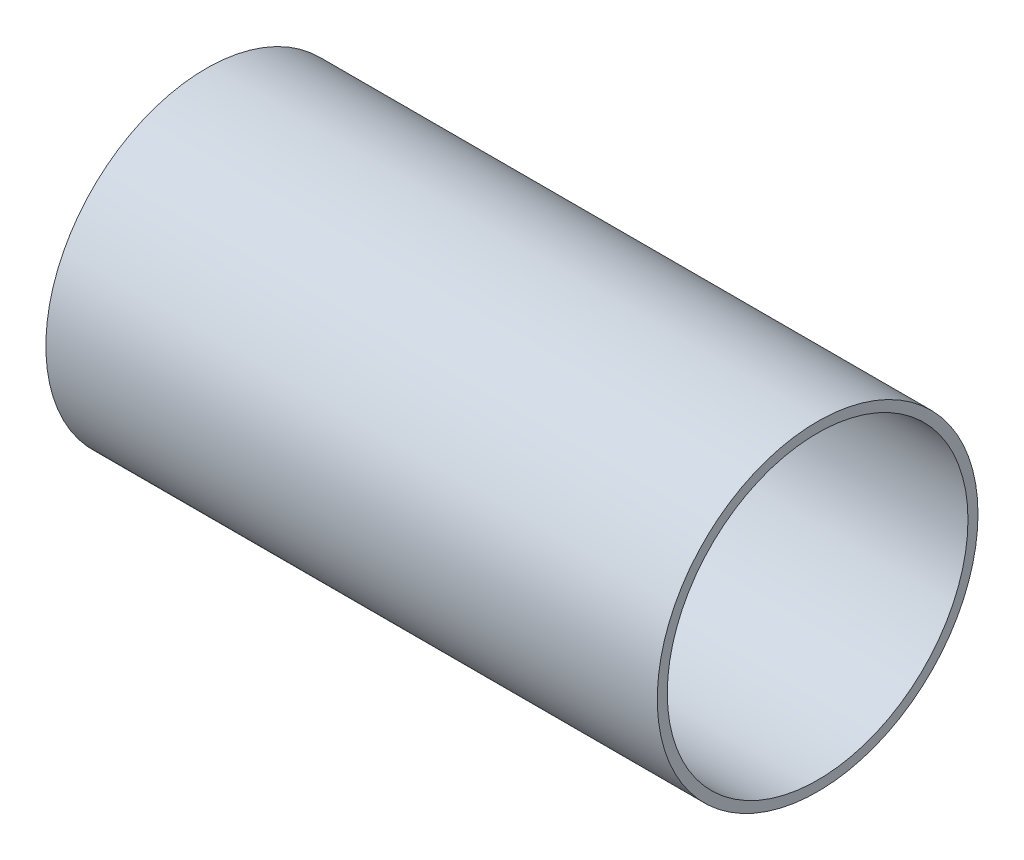
ISO-10303-21;
HEADER;
FILE_DESCRIPTION(('STEP AP214'),'2;1');
FILE_NAME('part.step','',(''),(''),'','','');
FILE_SCHEMA(('AUTOMOTIVE_DESIGN { 1 0 10303 214 1 1 1 1 }'));
ENDSEC;
DATA;
#1=APPLICATION_CONTEXT('core data for automotive mechanical design processes');
#2=APPLICATION_PROTOCOL_DEFINITION('international standard','automotive_design',2000,#1);
#3=PRODUCT_CONTEXT('',#1,'mechanical');
#4=PRODUCT('Part','Part','',(#3));
#5=PRODUCT_RELATED_PRODUCT_CATEGORY('part','',(#4));
#6=PRODUCT_DEFINITION_FORMATION('','',#4);
#7=PRODUCT_DEFINITION_CONTEXT('part definition',#1,'design');
#8=PRODUCT_DEFINITION('design','',#6,#7);
#9=PRODUCT_DEFINITION_SHAPE('','',#8);
#10=(LENGTH_UNIT() NAMED_UNIT(*) SI_UNIT(.MILLI.,.METRE.));
#11=(NAMED_UNIT(*) PLANE_ANGLE_UNIT() SI_UNIT($,.RADIAN.));
#12=(NAMED_UNIT(*) SI_UNIT($,.STERADIAN.) SOLID_ANGLE_UNIT());
#13=UNCERTAINTY_MEASURE_WITH_UNIT(LENGTH_MEASURE(1.E-05),#10,'distance_accuracy_value','');
#14=(GEOMETRIC_REPRESENTATION_CONTEXT(3) GLOBAL_UNCERTAINTY_ASSIGNED_CONTEXT((#13)) GLOBAL_UNIT_ASSIGNED_CONTEXT((#10,
#11,#12)) REPRESENTATION_CONTEXT('',''));
#15=CARTESIAN_POINT('',(0.,0.,0.));
#16=DIRECTION('',(0.,0.,1.));
#17=DIRECTION('',(1.,0.,0.));
#18=AXIS2_PLACEMENT_3D('',#15,#16,#17);
#19=CARTESIAN_POINT('',(387.35,0.,0.));
#20=DIRECTION('',(1.,0.,0.));
#21=DIRECTION('',(0.,0.,-1.));
#22=AXIS2_PLACEMENT_3D('',#19,#20,#21);
#23=PLANE('',#22);
#24=CARTESIAN_POINT('',(387.35,0.,0.));
#25=DIRECTION('',(1.,0.,0.));
#26=DIRECTION('',(0.,0.,-1.));
#27=AXIS2_PLACEMENT_3D('',#24,#25,#26);
#28=CIRCLE('',#27,101.6);
#29=CARTESIAN_POINT('',(387.35,0.,-101.6));
#30=VERTEX_POINT('',#29);
#31=EDGE_CURVE('E10',#30,#30,#28,.T.);
#32=ORIENTED_EDGE('',*,*,#31,.T.);
#33=EDGE_LOOP('',(#32));
#34=FACE_BOUND('',#33,.T.);
#35=CARTESIAN_POINT('',(387.35,0.,0.));
#36=DIRECTION('',(1.,0.,0.));
#37=DIRECTION('',(0.,0.,-1.));
#38=AXIS2_PLACEMENT_3D('',#35,#36,#37);
#39=CIRCLE('',#38,95.25);
#40=CARTESIAN_POINT('',(387.35,0.,-95.25));
#41=VERTEX_POINT('',#40);
#42=EDGE_CURVE('E54',#41,#41,#39,.T.);
#43=ORIENTED_EDGE('',*,*,#42,.F.);
#44=EDGE_LOOP('',(#43));
#45=FACE_BOUND('',#44,.T.);
#46=ADVANCED_FACE('F41',(#34,#45),#23,.T.);
#47=CARTESIAN_POINT('',(0.,0.,0.));
#48=DIRECTION('',(1.,0.,0.));
#49=DIRECTION('',(0.,0.,-1.));
#50=AXIS2_PLACEMENT_3D('',#47,#48,#49);
#51=PLANE('',#50);
#52=CARTESIAN_POINT('',(0.,0.,0.));
#53=DIRECTION('',(1.,0.,0.));
#54=DIRECTION('',(0.,0.,-1.));
#55=AXIS2_PLACEMENT_3D('',#52,#53,#54);
#56=CIRCLE('',#55,101.6);
#57=CARTESIAN_POINT('',(0.,0.,-101.6));
#58=VERTEX_POINT('',#57);
#59=EDGE_CURVE('E45',#58,#58,#56,.T.);
#60=ORIENTED_EDGE('',*,*,#59,.F.);
#61=EDGE_LOOP('',(#60));
#62=FACE_BOUND('',#61,.T.);
#63=CARTESIAN_POINT('',(0.,0.,0.));
#64=DIRECTION('',(1.,0.,0.));
#65=DIRECTION('',(0.,0.,-1.));
#66=AXIS2_PLACEMENT_3D('',#63,#64,#65);
#67=CIRCLE('',#66,95.25);
#68=CARTESIAN_POINT('',(0.,0.,-95.25));
#69=VERTEX_POINT('',#68);
#70=EDGE_CURVE('E56',#69,#69,#67,.T.);
#71=ORIENTED_EDGE('',*,*,#70,.T.);
#72=EDGE_LOOP('',(#71));
#73=FACE_BOUND('',#72,.T.);
#74=ADVANCED_FACE('F68',(#62,#73),#51,.F.);
#75=CARTESIAN_POINT('',(387.35,0.,0.));
#76=DIRECTION('',(-1.,0.,0.));
#77=DIRECTION('',(0.,0.,1.));
#78=AXIS2_PLACEMENT_3D('',#75,#76,#77);
#79=CYLINDRICAL_SURFACE('',#78,101.6);
#80=ORIENTED_EDGE('',*,*,#31,.F.);
#81=EDGE_LOOP('',(#80));
#82=FACE_BOUND('',#81,.T.);
#83=ORIENTED_EDGE('',*,*,#59,.T.);
#84=EDGE_LOOP('',(#83));
#85=FACE_BOUND('',#84,.T.);
#86=ADVANCED_FACE('F43',(#82,#85),#79,.T.);
#87=CARTESIAN_POINT('',(387.35,0.,0.));
#88=DIRECTION('',(-1.,0.,0.));
#89=DIRECTION('',(0.,0.,1.));
#90=AXIS2_PLACEMENT_3D('',#87,#88,#89);
#91=CYLINDRICAL_SURFACE('',#90,95.25);
#92=ORIENTED_EDGE('',*,*,#42,.T.);
#93=EDGE_LOOP('',(#92));
#94=FACE_BOUND('',#93,.T.);
#95=ORIENTED_EDGE('',*,*,#70,.F.);
#96=EDGE_LOOP('',(#95));
#97=FACE_BOUND('',#96,.T.);
#98=ADVANCED_FACE('F64',(#94,#97),#91,.F.);
#99=CLOSED_SHELL('',(#46,#74,#86,#98));
#100=MANIFOLD_SOLID_BREP('B2',#99);
#101=ADVANCED_BREP_SHAPE_REPRESENTATION('',(#18,#100),#14);
#102=SHAPE_DEFINITION_REPRESENTATION(#9,#101);
ENDSEC;
END-ISO-10303-21;
